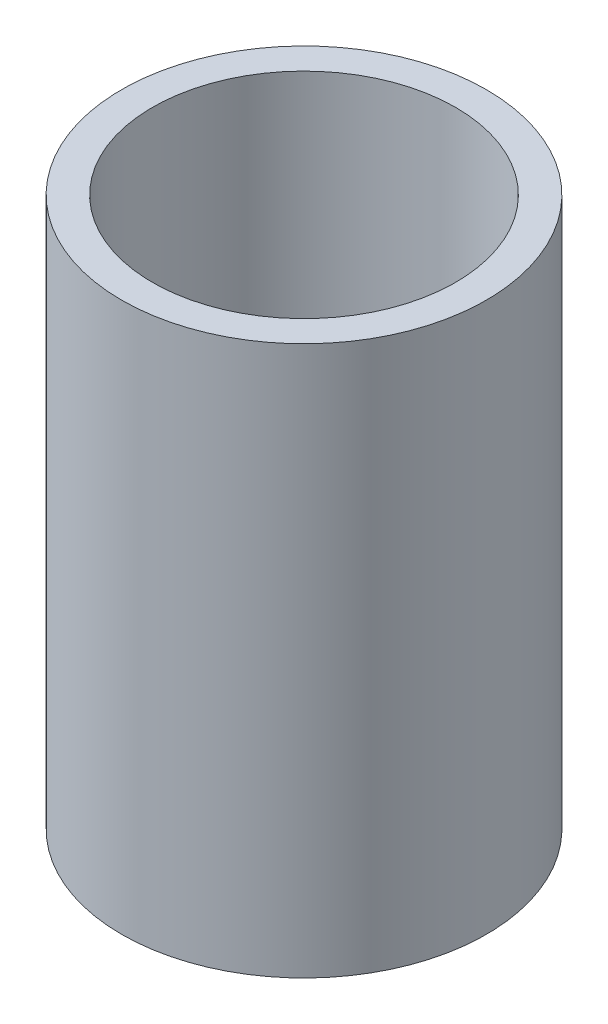
ISO-10303-21;
HEADER;
FILE_DESCRIPTION(('STEP AP214'),'2;1');
FILE_NAME('part.step','',(''),(''),'','','');
FILE_SCHEMA(('AUTOMOTIVE_DESIGN { 1 0 10303 214 1 1 1 1 }'));
ENDSEC;
DATA;
#1=APPLICATION_CONTEXT('core data for automotive mechanical design processes');
#2=APPLICATION_PROTOCOL_DEFINITION('international standard','automotive_design',2000,#1);
#3=PRODUCT_CONTEXT('',#1,'mechanical');
#4=PRODUCT('Part','Part','',(#3));
#5=PRODUCT_RELATED_PRODUCT_CATEGORY('part','',(#4));
#6=PRODUCT_DEFINITION_FORMATION('','',#4);
#7=PRODUCT_DEFINITION_CONTEXT('part definition',#1,'design');
#8=PRODUCT_DEFINITION('design','',#6,#7);
#9=PRODUCT_DEFINITION_SHAPE('','',#8);
#10=(LENGTH_UNIT() NAMED_UNIT(*) SI_UNIT(.MILLI.,.METRE.));
#11=(NAMED_UNIT(*) PLANE_ANGLE_UNIT() SI_UNIT($,.RADIAN.));
#12=(NAMED_UNIT(*) SI_UNIT($,.STERADIAN.) SOLID_ANGLE_UNIT());
#13=UNCERTAINTY_MEASURE_WITH_UNIT(LENGTH_MEASURE(1.E-05),#10,'distance_accuracy_value','');
#14=(GEOMETRIC_REPRESENTATION_CONTEXT(3) GLOBAL_UNCERTAINTY_ASSIGNED_CONTEXT((#13)) GLOBAL_UNIT_ASSIGNED_CONTEXT((#10,
#11,#12)) REPRESENTATION_CONTEXT('',''));
#15=CARTESIAN_POINT('',(0.,0.,0.));
#16=DIRECTION('',(0.,0.,1.));
#17=DIRECTION('',(1.,0.,0.));
#18=AXIS2_PLACEMENT_3D('',#15,#16,#17);
#19=CARTESIAN_POINT('',(0.,63.5,0.));
#20=DIRECTION('',(0.,1.,0.));
#21=DIRECTION('',(0.,0.,-1.));
#22=AXIS2_PLACEMENT_3D('',#19,#20,#21);
#23=PLANE('',#22);
#24=CARTESIAN_POINT('',(0.,63.5,0.));
#25=DIRECTION('',(0.,-1.,0.));
#26=DIRECTION('',(0.,0.,-1.));
#27=AXIS2_PLACEMENT_3D('',#24,#25,#26);
#28=CIRCLE('',#27,21.082);
#29=CARTESIAN_POINT('',(0.,63.5,-21.082));
#30=VERTEX_POINT('',#29);
#31=EDGE_CURVE('E10',#30,#30,#28,.T.);
#32=ORIENTED_EDGE('',*,*,#31,.F.);
#33=EDGE_LOOP('',(#32));
#34=FACE_BOUND('',#33,.T.);
#35=CARTESIAN_POINT('',(0.,63.5,0.));
#36=DIRECTION('',(0.,-1.,0.));
#37=DIRECTION('',(0.,0.,-1.));
#38=AXIS2_PLACEMENT_3D('',#35,#36,#37);
#39=CIRCLE('',#38,17.526);
#40=CARTESIAN_POINT('',(0.,63.5,-17.526));
#41=VERTEX_POINT('',#40);
#42=EDGE_CURVE('E46',#41,#41,#39,.T.);
#43=ORIENTED_EDGE('',*,*,#42,.T.);
#44=EDGE_LOOP('',(#43));
#45=FACE_BOUND('',#44,.T.);
#46=ADVANCED_FACE('F35',(#34,#45),#23,.T.);
#47=CARTESIAN_POINT('',(0.,0.,0.));
#48=DIRECTION('',(0.,1.,0.));
#49=DIRECTION('',(0.,0.,-1.));
#50=AXIS2_PLACEMENT_3D('',#47,#48,#49);
#51=PLANE('',#50);
#52=CARTESIAN_POINT('',(0.,0.,0.));
#53=DIRECTION('',(0.,-1.,0.));
#54=DIRECTION('',(0.,0.,-1.));
#55=AXIS2_PLACEMENT_3D('',#52,#53,#54);
#56=CIRCLE('',#55,21.082);
#57=CARTESIAN_POINT('',(0.,0.,-21.082));
#58=VERTEX_POINT('',#57);
#59=EDGE_CURVE('E39',#58,#58,#56,.T.);
#60=ORIENTED_EDGE('',*,*,#59,.T.);
#61=EDGE_LOOP('',(#60));
#62=FACE_BOUND('',#61,.T.);
#63=CARTESIAN_POINT('',(0.,0.,0.));
#64=DIRECTION('',(0.,-1.,0.));
#65=DIRECTION('',(0.,0.,-1.));
#66=AXIS2_PLACEMENT_3D('',#63,#64,#65);
#67=CIRCLE('',#66,17.526);
#68=CARTESIAN_POINT('',(0.,0.,-17.526));
#69=VERTEX_POINT('',#68);
#70=EDGE_CURVE('E48',#69,#69,#67,.T.);
#71=ORIENTED_EDGE('',*,*,#70,.F.);
#72=EDGE_LOOP('',(#71));
#73=FACE_BOUND('',#72,.T.);
#74=ADVANCED_FACE('F61',(#62,#73),#51,.F.);
#75=CARTESIAN_POINT('',(0.,63.5,0.));
#76=DIRECTION('',(0.,-1.,0.));
#77=DIRECTION('',(0.,0.,1.));
#78=AXIS2_PLACEMENT_3D('',#75,#76,#77);
#79=CYLINDRICAL_SURFACE('',#78,21.082);
#80=ORIENTED_EDGE('',*,*,#31,.T.);
#81=EDGE_LOOP('',(#80));
#82=FACE_BOUND('',#81,.T.);
#83=ORIENTED_EDGE('',*,*,#59,.F.);
#84=EDGE_LOOP('',(#83));
#85=FACE_BOUND('',#84,.T.);
#86=ADVANCED_FACE('F37',(#82,#85),#79,.T.);
#87=CARTESIAN_POINT('',(0.,63.5,0.));
#88=DIRECTION('',(0.,-1.,0.));
#89=DIRECTION('',(0.,0.,1.));
#90=AXIS2_PLACEMENT_3D('',#87,#88,#89);
#91=CYLINDRICAL_SURFACE('',#90,17.526);
#92=ORIENTED_EDGE('',*,*,#42,.F.);
#93=EDGE_LOOP('',(#92));
#94=FACE_BOUND('',#93,.T.);
#95=ORIENTED_EDGE('',*,*,#70,.T.);
#96=EDGE_LOOP('',(#95));
#97=FACE_BOUND('',#96,.T.);
#98=ADVANCED_FACE('F55',(#94,#97),#91,.F.);
#99=CLOSED_SHELL('',(#46,#74,#86,#98));
#100=MANIFOLD_SOLID_BREP('B2',#99);
#101=ADVANCED_BREP_SHAPE_REPRESENTATION('',(#18,#100),#14);
#102=SHAPE_DEFINITION_REPRESENTATION(#9,#101);
ENDSEC;
END-ISO-10303-21;
